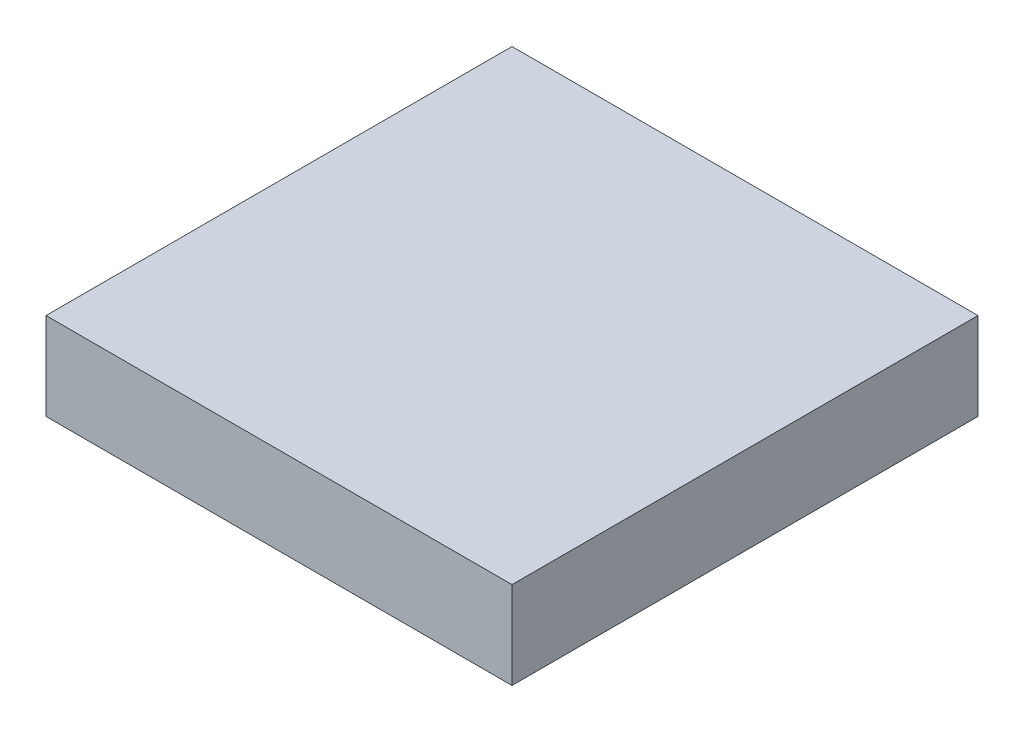
ISO-10303-21;
HEADER;
FILE_DESCRIPTION(('STEP AP214'),'2;1');
FILE_NAME('part.step','',(''),(''),'','','');
FILE_SCHEMA(('AUTOMOTIVE_DESIGN { 1 0 10303 214 1 1 1 1 }'));
ENDSEC;
DATA;
#1=APPLICATION_CONTEXT('core data for automotive mechanical design processes');
#2=APPLICATION_PROTOCOL_DEFINITION('international standard','automotive_design',2000,#1);
#3=PRODUCT_CONTEXT('',#1,'mechanical');
#4=PRODUCT('Part','Part','',(#3));
#5=PRODUCT_RELATED_PRODUCT_CATEGORY('part','',(#4));
#6=PRODUCT_DEFINITION_FORMATION('','',#4);
#7=PRODUCT_DEFINITION_CONTEXT('part definition',#1,'design');
#8=PRODUCT_DEFINITION('design','',#6,#7);
#9=PRODUCT_DEFINITION_SHAPE('','',#8);
#10=(LENGTH_UNIT() NAMED_UNIT(*) SI_UNIT(.MILLI.,.METRE.));
#11=(NAMED_UNIT(*) PLANE_ANGLE_UNIT() SI_UNIT($,.RADIAN.));
#12=(NAMED_UNIT(*) SI_UNIT($,.STERADIAN.) SOLID_ANGLE_UNIT());
#13=UNCERTAINTY_MEASURE_WITH_UNIT(LENGTH_MEASURE(1.E-05),#10,'distance_accuracy_value','');
#14=(GEOMETRIC_REPRESENTATION_CONTEXT(3) GLOBAL_UNCERTAINTY_ASSIGNED_CONTEXT((#13)) GLOBAL_UNIT_ASSIGNED_CONTEXT((#10,
#11,#12)) REPRESENTATION_CONTEXT('',''));
#15=CARTESIAN_POINT('',(0.,0.,0.));
#16=DIRECTION('',(0.,0.,1.));
#17=DIRECTION('',(1.,0.,0.));
#18=AXIS2_PLACEMENT_3D('',#15,#16,#17);
#19=CARTESIAN_POINT('',(8.,3.,8.));
#20=DIRECTION('',(-1.,0.,0.));
#21=DIRECTION('',(0.,0.,1.));
#22=AXIS2_PLACEMENT_3D('',#19,#20,#21);
#23=PLANE('',#22);
#24=DIRECTION('',(0.,0.,-1.));
#25=VECTOR('',#24,1.);
#26=CARTESIAN_POINT('',(8.,0.,8.));
#27=LINE('',#26,#25);
#28=CARTESIAN_POINT('',(8.,0.,8.));
#29=VERTEX_POINT('',#28);
#30=CARTESIAN_POINT('',(8.,0.,-8.));
#31=VERTEX_POINT('',#30);
#32=EDGE_CURVE('E145',#29,#31,#27,.T.);
#33=ORIENTED_EDGE('',*,*,#32,.T.);
#34=DIRECTION('',(0.,-1.,0.));
#35=VECTOR('',#34,1.);
#36=CARTESIAN_POINT('',(8.,3.,-8.));
#37=LINE('',#36,#35);
#38=CARTESIAN_POINT('',(8.,3.,-8.));
#39=VERTEX_POINT('',#38);
#40=EDGE_CURVE('E11',#39,#31,#37,.T.);
#41=ORIENTED_EDGE('',*,*,#40,.F.);
#42=DIRECTION('',(0.,0.,-1.));
#43=VECTOR('',#42,1.);
#44=CARTESIAN_POINT('',(8.,3.,8.));
#45=LINE('',#44,#43);
#46=CARTESIAN_POINT('',(8.,3.,8.));
#47=VERTEX_POINT('',#46);
#48=EDGE_CURVE('E149',#47,#39,#45,.T.);
#49=ORIENTED_EDGE('',*,*,#48,.F.);
#50=DIRECTION('',(0.,-1.,0.));
#51=VECTOR('',#50,1.);
#52=CARTESIAN_POINT('',(8.,3.,8.));
#53=LINE('',#52,#51);
#54=EDGE_CURVE('E155',#47,#29,#53,.T.);
#55=ORIENTED_EDGE('',*,*,#54,.T.);
#56=EDGE_LOOP('',(#33,#41,#49,#55));
#57=FACE_BOUND('',#56,.T.);
#58=ADVANCED_FACE('F33',(#57),#23,.F.);
#59=CARTESIAN_POINT('',(-8.,3.,-8.));
#60=DIRECTION('',(0.,0.,1.));
#61=DIRECTION('',(1.,0.,0.));
#62=AXIS2_PLACEMENT_3D('',#59,#60,#61);
#63=PLANE('',#62);
#64=DIRECTION('',(-1.,0.,0.));
#65=VECTOR('',#64,1.);
#66=CARTESIAN_POINT('',(-8.,0.,-8.));
#67=LINE('',#66,#65);
#68=CARTESIAN_POINT('',(-8.,0.,-8.));
#69=VERTEX_POINT('',#68);
#70=EDGE_CURVE('E158',#31,#69,#67,.T.);
#71=ORIENTED_EDGE('',*,*,#70,.T.);
#72=DIRECTION('',(0.,-1.,0.));
#73=VECTOR('',#72,1.);
#74=CARTESIAN_POINT('',(-8.,3.,-8.));
#75=LINE('',#74,#73);
#76=CARTESIAN_POINT('',(-8.,3.,-8.));
#77=VERTEX_POINT('',#76);
#78=EDGE_CURVE('E40',#77,#69,#75,.T.);
#79=ORIENTED_EDGE('',*,*,#78,.F.);
#80=DIRECTION('',(-1.,0.,0.));
#81=VECTOR('',#80,1.);
#82=CARTESIAN_POINT('',(-8.,3.,-8.));
#83=LINE('',#82,#81);
#84=EDGE_CURVE('E84',#39,#77,#83,.T.);
#85=ORIENTED_EDGE('',*,*,#84,.F.);
#86=ORIENTED_EDGE('',*,*,#40,.T.);
#87=EDGE_LOOP('',(#71,#79,#85,#86));
#88=FACE_BOUND('',#87,.T.);
#89=ADVANCED_FACE('F186',(#88),#63,.F.);
#90=CARTESIAN_POINT('',(-8.,3.,8.));
#91=DIRECTION('',(1.,0.,0.));
#92=DIRECTION('',(0.,0.,-1.));
#93=AXIS2_PLACEMENT_3D('',#90,#91,#92);
#94=PLANE('',#93);
#95=DIRECTION('',(0.,0.,1.));
#96=VECTOR('',#95,1.);
#97=CARTESIAN_POINT('',(-8.,0.,8.));
#98=LINE('',#97,#96);
#99=CARTESIAN_POINT('',(-8.,0.,8.));
#100=VERTEX_POINT('',#99);
#101=EDGE_CURVE('E160',#69,#100,#98,.T.);
#102=ORIENTED_EDGE('',*,*,#101,.T.);
#103=DIRECTION('',(0.,-1.,0.));
#104=VECTOR('',#103,1.);
#105=CARTESIAN_POINT('',(-8.,3.,8.));
#106=LINE('',#105,#104);
#107=CARTESIAN_POINT('',(-8.,3.,8.));
#108=VERTEX_POINT('',#107);
#109=EDGE_CURVE('E164',#108,#100,#106,.T.);
#110=ORIENTED_EDGE('',*,*,#109,.F.);
#111=DIRECTION('',(0.,0.,1.));
#112=VECTOR('',#111,1.);
#113=CARTESIAN_POINT('',(-8.,3.,8.));
#114=LINE('',#113,#112);
#115=EDGE_CURVE('E152',#77,#108,#114,.T.);
#116=ORIENTED_EDGE('',*,*,#115,.F.);
#117=ORIENTED_EDGE('',*,*,#78,.T.);
#118=EDGE_LOOP('',(#102,#110,#116,#117));
#119=FACE_BOUND('',#118,.T.);
#120=ADVANCED_FACE('F169',(#119),#94,.F.);
#121=CARTESIAN_POINT('',(-8.,3.,8.));
#122=DIRECTION('',(0.,0.,-1.));
#123=DIRECTION('',(-1.,0.,0.));
#124=AXIS2_PLACEMENT_3D('',#121,#122,#123);
#125=PLANE('',#124);
#126=DIRECTION('',(1.,0.,0.));
#127=VECTOR('',#126,1.);
#128=CARTESIAN_POINT('',(-8.,0.,8.));
#129=LINE('',#128,#127);
#130=EDGE_CURVE('E77',#100,#29,#129,.T.);
#131=ORIENTED_EDGE('',*,*,#130,.T.);
#132=ORIENTED_EDGE('',*,*,#54,.F.);
#133=DIRECTION('',(1.,0.,0.));
#134=VECTOR('',#133,1.);
#135=CARTESIAN_POINT('',(-8.,3.,8.));
#136=LINE('',#135,#134);
#137=EDGE_CURVE('E56',#108,#47,#136,.T.);
#138=ORIENTED_EDGE('',*,*,#137,.F.);
#139=ORIENTED_EDGE('',*,*,#109,.T.);
#140=EDGE_LOOP('',(#131,#132,#138,#139));
#141=FACE_BOUND('',#140,.T.);
#142=ADVANCED_FACE('F177',(#141),#125,.F.);
#143=CARTESIAN_POINT('',(0.,3.,0.));
#144=DIRECTION('',(0.,-1.,0.));
#145=DIRECTION('',(0.,0.,-1.));
#146=AXIS2_PLACEMENT_3D('',#143,#144,#145);
#147=PLANE('',#146);
#148=ORIENTED_EDGE('',*,*,#48,.T.);
#149=ORIENTED_EDGE('',*,*,#84,.T.);
#150=ORIENTED_EDGE('',*,*,#115,.T.);
#151=ORIENTED_EDGE('',*,*,#137,.T.);
#152=EDGE_LOOP('',(#148,#149,#150,#151));
#153=FACE_BOUND('',#152,.T.);
#154=ADVANCED_FACE('F179',(#153),#147,.F.);
#155=CARTESIAN_POINT('',(0.,0.,0.));
#156=DIRECTION('',(0.,-1.,0.));
#157=DIRECTION('',(0.,0.,-1.));
#158=AXIS2_PLACEMENT_3D('',#155,#156,#157);
#159=PLANE('',#158);
#160=CARTESIAN_POINT('',(-7.,0.,-7.));
#161=DIRECTION('',(0.,-1.,0.));
#162=DIRECTION('',(0.,0.,-1.));
#163=AXIS2_PLACEMENT_3D('',#160,#161,#162);
#164=CIRCLE('',#163,0.750000000000001);
#165=CARTESIAN_POINT('',(-7.,0.,-7.75));
#166=VERTEX_POINT('',#165);
#167=EDGE_CURVE('E369',#166,#166,#164,.T.);
#168=ORIENTED_EDGE('',*,*,#167,.F.);
#169=EDGE_LOOP('',(#168));
#170=FACE_BOUND('',#169,.T.);
#171=CARTESIAN_POINT('',(7.,0.,-7.));
#172=DIRECTION('',(0.,-1.,0.));
#173=DIRECTION('',(0.,0.,-1.));
#174=AXIS2_PLACEMENT_3D('',#171,#172,#173);
#175=CIRCLE('',#174,0.750000000000001);
#176=CARTESIAN_POINT('',(7.,0.,-7.75));
#177=VERTEX_POINT('',#176);
#178=EDGE_CURVE('E368',#177,#177,#175,.T.);
#179=ORIENTED_EDGE('',*,*,#178,.F.);
#180=EDGE_LOOP('',(#179));
#181=FACE_BOUND('',#180,.T.);
#182=CARTESIAN_POINT('',(7.,0.,7.));
#183=DIRECTION('',(0.,-1.,0.));
#184=DIRECTION('',(0.,0.,-1.));
#185=AXIS2_PLACEMENT_3D('',#182,#183,#184);
#186=CIRCLE('',#185,0.750000000000001);
#187=CARTESIAN_POINT('',(7.,0.,6.25));
#188=VERTEX_POINT('',#187);
#189=EDGE_CURVE('E392',#188,#188,#186,.T.);
#190=ORIENTED_EDGE('',*,*,#189,.F.);
#191=EDGE_LOOP('',(#190));
#192=FACE_BOUND('',#191,.T.);
#193=CARTESIAN_POINT('',(-7.,0.,7.));
#194=DIRECTION('',(0.,-1.,0.));
#195=DIRECTION('',(0.,0.,-1.));
#196=AXIS2_PLACEMENT_3D('',#193,#194,#195);
#197=CIRCLE('',#196,0.750000000000001);
#198=CARTESIAN_POINT('',(-7.,0.,6.25));
#199=VERTEX_POINT('',#198);
#200=EDGE_CURVE('E381',#199,#199,#197,.T.);
#201=ORIENTED_EDGE('',*,*,#200,.F.);
#202=EDGE_LOOP('',(#201));
#203=FACE_BOUND('',#202,.T.);
#204=DIRECTION('',(0.,0.,1.));
#205=VECTOR('',#204,1.);
#206=CARTESIAN_POINT('',(6.,0.,-6.));
#207=LINE('',#206,#205);
#208=CARTESIAN_POINT('',(6.,0.,-6.));
#209=VERTEX_POINT('',#208);
#210=CARTESIAN_POINT('',(6.,0.,6.));
#211=VERTEX_POINT('',#210);
#212=EDGE_CURVE('E47',#209,#211,#207,.T.);
#213=ORIENTED_EDGE('',*,*,#212,.F.);
#214=DIRECTION('',(1.,0.,0.));
#215=VECTOR('',#214,1.);
#216=CARTESIAN_POINT('',(-6.,0.,-6.));
#217=LINE('',#216,#215);
#218=CARTESIAN_POINT('',(-6.,0.,-6.));
#219=VERTEX_POINT('',#218);
#220=EDGE_CURVE('E126',#219,#209,#217,.T.);
#221=ORIENTED_EDGE('',*,*,#220,.F.);
#222=DIRECTION('',(0.,0.,-1.));
#223=VECTOR('',#222,1.);
#224=CARTESIAN_POINT('',(-6.,0.,-6.));
#225=LINE('',#224,#223);
#226=CARTESIAN_POINT('',(-6.,0.,6.));
#227=VERTEX_POINT('',#226);
#228=EDGE_CURVE('E129',#227,#219,#225,.T.);
#229=ORIENTED_EDGE('',*,*,#228,.F.);
#230=DIRECTION('',(-1.,0.,0.));
#231=VECTOR('',#230,1.);
#232=CARTESIAN_POINT('',(-6.,0.,6.));
#233=LINE('',#232,#231);
#234=EDGE_CURVE('E138',#211,#227,#233,.T.);
#235=ORIENTED_EDGE('',*,*,#234,.F.);
#236=EDGE_LOOP('',(#213,#221,#229,#235));
#237=FACE_BOUND('',#236,.T.);
#238=ORIENTED_EDGE('',*,*,#32,.F.);
#239=ORIENTED_EDGE('',*,*,#130,.F.);
#240=ORIENTED_EDGE('',*,*,#101,.F.);
#241=ORIENTED_EDGE('',*,*,#70,.F.);
#242=EDGE_LOOP('',(#238,#239,#240,#241));
#243=FACE_BOUND('',#242,.T.);
#244=ADVANCED_FACE('F173',(#170,#181,#192,#203,#237,#243),#159,.T.);
#245=CARTESIAN_POINT('',(6.,2.,-6.));
#246=DIRECTION('',(1.,0.,0.));
#247=DIRECTION('',(0.,0.,-1.));
#248=AXIS2_PLACEMENT_3D('',#245,#246,#247);
#249=PLANE('',#248);
#250=ORIENTED_EDGE('',*,*,#212,.T.);
#251=DIRECTION('',(0.,-1.,0.));
#252=VECTOR('',#251,1.);
#253=CARTESIAN_POINT('',(6.,2.,6.));
#254=LINE('',#253,#252);
#255=CARTESIAN_POINT('',(6.,2.,6.));
#256=VERTEX_POINT('',#255);
#257=EDGE_CURVE('E104',#256,#211,#254,.T.);
#258=ORIENTED_EDGE('',*,*,#257,.F.);
#259=DIRECTION('',(0.,0.,1.));
#260=VECTOR('',#259,1.);
#261=CARTESIAN_POINT('',(6.,2.,-6.));
#262=LINE('',#261,#260);
#263=CARTESIAN_POINT('',(6.,2.,-6.));
#264=VERTEX_POINT('',#263);
#265=EDGE_CURVE('E108',#264,#256,#262,.T.);
#266=ORIENTED_EDGE('',*,*,#265,.F.);
#267=DIRECTION('',(0.,-1.,0.));
#268=VECTOR('',#267,1.);
#269=CARTESIAN_POINT('',(6.,2.,-6.));
#270=LINE('',#269,#268);
#271=EDGE_CURVE('E143',#264,#209,#270,.T.);
#272=ORIENTED_EDGE('',*,*,#271,.T.);
#273=EDGE_LOOP('',(#250,#258,#266,#272));
#274=FACE_BOUND('',#273,.T.);
#275=ADVANCED_FACE('F106',(#274),#249,.F.);
#276=CARTESIAN_POINT('',(-6.,2.,-6.));
#277=DIRECTION('',(0.,0.,-1.));
#278=DIRECTION('',(-1.,0.,0.));
#279=AXIS2_PLACEMENT_3D('',#276,#277,#278);
#280=PLANE('',#279);
#281=ORIENTED_EDGE('',*,*,#220,.T.);
#282=ORIENTED_EDGE('',*,*,#271,.F.);
#283=DIRECTION('',(1.,0.,0.));
#284=VECTOR('',#283,1.);
#285=CARTESIAN_POINT('',(-6.,2.,-6.));
#286=LINE('',#285,#284);
#287=CARTESIAN_POINT('',(-6.,2.,-6.));
#288=VERTEX_POINT('',#287);
#289=EDGE_CURVE('E114',#288,#264,#286,.T.);
#290=ORIENTED_EDGE('',*,*,#289,.F.);
#291=DIRECTION('',(0.,-1.,0.));
#292=VECTOR('',#291,1.);
#293=CARTESIAN_POINT('',(-6.,2.,-6.));
#294=LINE('',#293,#292);
#295=EDGE_CURVE('E146',#288,#219,#294,.T.);
#296=ORIENTED_EDGE('',*,*,#295,.T.);
#297=EDGE_LOOP('',(#281,#282,#290,#296));
#298=FACE_BOUND('',#297,.T.);
#299=ADVANCED_FACE('F220',(#298),#280,.F.);
#300=CARTESIAN_POINT('',(-6.,2.,-6.));
#301=DIRECTION('',(-1.,0.,0.));
#302=DIRECTION('',(0.,0.,1.));
#303=AXIS2_PLACEMENT_3D('',#300,#301,#302);
#304=PLANE('',#303);
#305=ORIENTED_EDGE('',*,*,#228,.T.);
#306=ORIENTED_EDGE('',*,*,#295,.F.);
#307=DIRECTION('',(0.,0.,-1.));
#308=VECTOR('',#307,1.);
#309=CARTESIAN_POINT('',(-6.,2.,-6.));
#310=LINE('',#309,#308);
#311=CARTESIAN_POINT('',(-6.,2.,6.));
#312=VERTEX_POINT('',#311);
#313=EDGE_CURVE('E122',#312,#288,#310,.T.);
#314=ORIENTED_EDGE('',*,*,#313,.F.);
#315=DIRECTION('',(0.,-1.,0.));
#316=VECTOR('',#315,1.);
#317=CARTESIAN_POINT('',(-6.,2.,6.));
#318=LINE('',#317,#316);
#319=EDGE_CURVE('E113',#312,#227,#318,.T.);
#320=ORIENTED_EDGE('',*,*,#319,.T.);
#321=EDGE_LOOP('',(#305,#306,#314,#320));
#322=FACE_BOUND('',#321,.T.);
#323=ADVANCED_FACE('F230',(#322),#304,.F.);
#324=CARTESIAN_POINT('',(-6.,2.,6.));
#325=DIRECTION('',(0.,0.,1.));
#326=DIRECTION('',(1.,0.,0.));
#327=AXIS2_PLACEMENT_3D('',#324,#325,#326);
#328=PLANE('',#327);
#329=ORIENTED_EDGE('',*,*,#234,.T.);
#330=ORIENTED_EDGE('',*,*,#319,.F.);
#331=DIRECTION('',(-1.,0.,0.));
#332=VECTOR('',#331,1.);
#333=CARTESIAN_POINT('',(-6.,2.,6.));
#334=LINE('',#333,#332);
#335=EDGE_CURVE('E117',#256,#312,#334,.T.);
#336=ORIENTED_EDGE('',*,*,#335,.F.);
#337=ORIENTED_EDGE('',*,*,#257,.T.);
#338=EDGE_LOOP('',(#329,#330,#336,#337));
#339=FACE_BOUND('',#338,.T.);
#340=ADVANCED_FACE('F118',(#339),#328,.F.);
#341=CARTESIAN_POINT('',(0.,2.,0.));
#342=DIRECTION('',(0.,1.,0.));
#343=DIRECTION('',(0.,0.,1.));
#344=AXIS2_PLACEMENT_3D('',#341,#342,#343);
#345=PLANE('',#344);
#346=CARTESIAN_POINT('',(0.,2.,0.));
#347=DIRECTION('',(0.,-1.,0.));
#348=DIRECTION('',(0.,0.,-1.));
#349=AXIS2_PLACEMENT_3D('',#346,#347,#348);
#350=CIRCLE('',#349,2.5);
#351=CARTESIAN_POINT('',(0.,2.,-2.5));
#352=VERTEX_POINT('',#351);
#353=EDGE_CURVE('E139',#352,#352,#350,.T.);
#354=ORIENTED_EDGE('',*,*,#353,.F.);
#355=EDGE_LOOP('',(#354));
#356=FACE_BOUND('',#355,.T.);
#357=ORIENTED_EDGE('',*,*,#265,.T.);
#358=ORIENTED_EDGE('',*,*,#335,.T.);
#359=ORIENTED_EDGE('',*,*,#313,.T.);
#360=ORIENTED_EDGE('',*,*,#289,.T.);
#361=EDGE_LOOP('',(#357,#358,#359,#360));
#362=FACE_BOUND('',#361,.T.);
#363=ADVANCED_FACE('F124',(#356,#362),#345,.F.);
#364=CARTESIAN_POINT('',(0.,2.,0.));
#365=DIRECTION('',(0.,-1.,0.));
#366=DIRECTION('',(0.,0.,-1.));
#367=AXIS2_PLACEMENT_3D('',#364,#365,#366);
#368=CYLINDRICAL_SURFACE('',#367,2.5);
#369=ORIENTED_EDGE('',*,*,#353,.T.);
#370=EDGE_LOOP('',(#369));
#371=FACE_BOUND('',#370,.T.);
#372=CARTESIAN_POINT('',(0.,0.,0.));
#373=DIRECTION('',(0.,-1.,0.));
#374=DIRECTION('',(0.,0.,-1.));
#375=AXIS2_PLACEMENT_3D('',#372,#373,#374);
#376=CIRCLE('',#375,2.5);
#377=CARTESIAN_POINT('',(0.,0.,-2.5));
#378=VERTEX_POINT('',#377);
#379=EDGE_CURVE('E132',#378,#378,#376,.T.);
#380=ORIENTED_EDGE('',*,*,#379,.F.);
#381=EDGE_LOOP('',(#380));
#382=FACE_BOUND('',#381,.T.);
#383=ADVANCED_FACE('F257',(#371,#382),#368,.T.);
#384=ORIENTED_EDGE('',*,*,#379,.T.);
#385=EDGE_LOOP('',(#384));
#386=FACE_BOUND('',#385,.T.);
#387=ADVANCED_FACE('F267',(#386),#159,.T.);
#388=CARTESIAN_POINT('',(-7.,2.,7.));
#389=DIRECTION('',(0.,-1.,0.));
#390=DIRECTION('',(0.,0.,-1.));
#391=AXIS2_PLACEMENT_3D('',#388,#389,#390);
#392=CYLINDRICAL_SURFACE('',#391,0.750000000000001);
#393=CARTESIAN_POINT('',(-7.,2.,7.));
#394=DIRECTION('',(0.,-1.,0.));
#395=DIRECTION('',(0.,0.,-1.));
#396=AXIS2_PLACEMENT_3D('',#393,#394,#395);
#397=CIRCLE('',#396,0.750000000000001);
#398=CARTESIAN_POINT('',(-7.,2.,6.25));
#399=VERTEX_POINT('',#398);
#400=EDGE_CURVE('E378',#399,#399,#397,.T.);
#401=ORIENTED_EDGE('',*,*,#400,.F.);
#402=EDGE_LOOP('',(#401));
#403=FACE_BOUND('',#402,.T.);
#404=ORIENTED_EDGE('',*,*,#200,.T.);
#405=EDGE_LOOP('',(#404));
#406=FACE_BOUND('',#405,.T.);
#407=ADVANCED_FACE('F277',(#403,#406),#392,.F.);
#408=CARTESIAN_POINT('',(-7.,2.,7.));
#409=DIRECTION('',(0.,-1.,0.));
#410=DIRECTION('',(0.,0.,-1.));
#411=AXIS2_PLACEMENT_3D('',#408,#409,#410);
#412=PLANE('',#411);
#413=ORIENTED_EDGE('',*,*,#400,.T.);
#414=EDGE_LOOP('',(#413));
#415=FACE_BOUND('',#414,.T.);
#416=ADVANCED_FACE('F291',(#415),#412,.T.);
#417=CARTESIAN_POINT('',(7.,2.,7.));
#418=DIRECTION('',(0.,-1.,0.));
#419=DIRECTION('',(0.,0.,-1.));
#420=AXIS2_PLACEMENT_3D('',#417,#418,#419);
#421=CYLINDRICAL_SURFACE('',#420,0.750000000000001);
#422=CARTESIAN_POINT('',(7.,2.,7.));
#423=DIRECTION('',(0.,-1.,0.));
#424=DIRECTION('',(0.,0.,-1.));
#425=AXIS2_PLACEMENT_3D('',#422,#423,#424);
#426=CIRCLE('',#425,0.750000000000001);
#427=CARTESIAN_POINT('',(7.,2.,6.25));
#428=VERTEX_POINT('',#427);
#429=EDGE_CURVE('E383',#428,#428,#426,.T.);
#430=ORIENTED_EDGE('',*,*,#429,.F.);
#431=EDGE_LOOP('',(#430));
#432=FACE_BOUND('',#431,.T.);
#433=ORIENTED_EDGE('',*,*,#189,.T.);
#434=EDGE_LOOP('',(#433));
#435=FACE_BOUND('',#434,.T.);
#436=ADVANCED_FACE('F301',(#432,#435),#421,.F.);
#437=CARTESIAN_POINT('',(7.,2.,7.));
#438=DIRECTION('',(0.,-1.,0.));
#439=DIRECTION('',(0.,0.,-1.));
#440=AXIS2_PLACEMENT_3D('',#437,#438,#439);
#441=PLANE('',#440);
#442=ORIENTED_EDGE('',*,*,#429,.T.);
#443=EDGE_LOOP('',(#442));
#444=FACE_BOUND('',#443,.T.);
#445=ADVANCED_FACE('F311',(#444),#441,.T.);
#446=CARTESIAN_POINT('',(7.,2.,-7.));
#447=DIRECTION('',(0.,-1.,0.));
#448=DIRECTION('',(0.,0.,-1.));
#449=AXIS2_PLACEMENT_3D('',#446,#447,#448);
#450=CYLINDRICAL_SURFACE('',#449,0.750000000000001);
#451=CARTESIAN_POINT('',(7.,2.,-7.));
#452=DIRECTION('',(0.,-1.,0.));
#453=DIRECTION('',(0.,0.,-1.));
#454=AXIS2_PLACEMENT_3D('',#451,#452,#453);
#455=CIRCLE('',#454,0.750000000000001);
#456=CARTESIAN_POINT('',(7.,2.,-7.75));
#457=VERTEX_POINT('',#456);
#458=EDGE_CURVE('E372',#457,#457,#455,.T.);
#459=ORIENTED_EDGE('',*,*,#458,.F.);
#460=EDGE_LOOP('',(#459));
#461=FACE_BOUND('',#460,.T.);
#462=ORIENTED_EDGE('',*,*,#178,.T.);
#463=EDGE_LOOP('',(#462));
#464=FACE_BOUND('',#463,.T.);
#465=ADVANCED_FACE('F321',(#461,#464),#450,.F.);
#466=CARTESIAN_POINT('',(7.,2.,-7.));
#467=DIRECTION('',(0.,-1.,0.));
#468=DIRECTION('',(0.,0.,-1.));
#469=AXIS2_PLACEMENT_3D('',#466,#467,#468);
#470=PLANE('',#469);
#471=ORIENTED_EDGE('',*,*,#458,.T.);
#472=EDGE_LOOP('',(#471));
#473=FACE_BOUND('',#472,.T.);
#474=ADVANCED_FACE('F331',(#473),#470,.T.);
#475=CARTESIAN_POINT('',(-7.,2.,-7.));
#476=DIRECTION('',(0.,-1.,0.));
#477=DIRECTION('',(0.,0.,-1.));
#478=AXIS2_PLACEMENT_3D('',#475,#476,#477);
#479=CYLINDRICAL_SURFACE('',#478,0.750000000000001);
#480=CARTESIAN_POINT('',(-7.,2.,-7.));
#481=DIRECTION('',(0.,-1.,0.));
#482=DIRECTION('',(0.,0.,-1.));
#483=AXIS2_PLACEMENT_3D('',#480,#481,#482);
#484=CIRCLE('',#483,0.750000000000001);
#485=CARTESIAN_POINT('',(-7.,2.,-7.75));
#486=VERTEX_POINT('',#485);
#487=EDGE_CURVE('E367',#486,#486,#484,.T.);
#488=ORIENTED_EDGE('',*,*,#487,.F.);
#489=EDGE_LOOP('',(#488));
#490=FACE_BOUND('',#489,.T.);
#491=ORIENTED_EDGE('',*,*,#167,.T.);
#492=EDGE_LOOP('',(#491));
#493=FACE_BOUND('',#492,.T.);
#494=ADVANCED_FACE('F341',(#490,#493),#479,.F.);
#495=CARTESIAN_POINT('',(-7.,2.,-7.));
#496=DIRECTION('',(0.,-1.,0.));
#497=DIRECTION('',(0.,0.,-1.));
#498=AXIS2_PLACEMENT_3D('',#495,#496,#497);
#499=PLANE('',#498);
#500=ORIENTED_EDGE('',*,*,#487,.T.);
#501=EDGE_LOOP('',(#500));
#502=FACE_BOUND('',#501,.T.);
#503=ADVANCED_FACE('F351',(#502),#499,.T.);
#504=CLOSED_SHELL('',(#58,#89,#120,#142,#154,#244,#275,#299,#323,#340,#363,#383,#387,#407,#416,
#436,#445,#465,#474,#494,#503));
#505=MANIFOLD_SOLID_BREP('B2',#504);
#506=ADVANCED_BREP_SHAPE_REPRESENTATION('',(#18,#505),#14);
#507=SHAPE_DEFINITION_REPRESENTATION(#9,#506);
ENDSEC;
END-ISO-10303-21;
